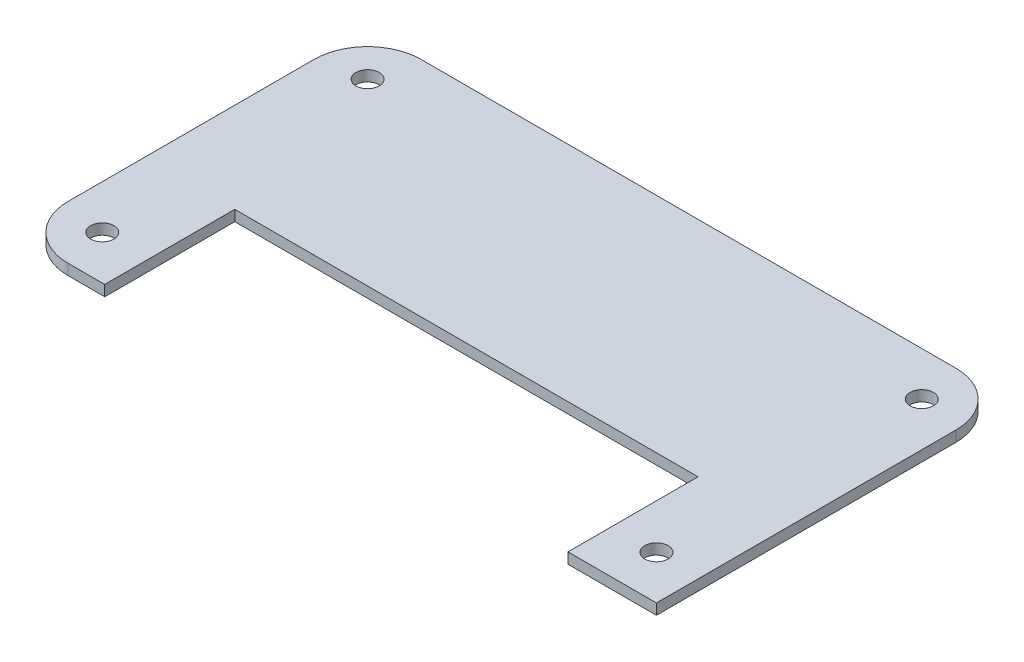
ISO-10303-21;
HEADER;
FILE_DESCRIPTION(('STEP AP214'),'2;1');
FILE_NAME('part.step','',(''),(''),'','','');
FILE_SCHEMA(('AUTOMOTIVE_DESIGN { 1 0 10303 214 1 1 1 1 }'));
ENDSEC;
DATA;
#1=APPLICATION_CONTEXT('core data for automotive mechanical design processes');
#2=APPLICATION_PROTOCOL_DEFINITION('international standard','automotive_design',2000,#1);
#3=PRODUCT_CONTEXT('',#1,'mechanical');
#4=PRODUCT('Part','Part','',(#3));
#5=PRODUCT_RELATED_PRODUCT_CATEGORY('part','',(#4));
#6=PRODUCT_DEFINITION_FORMATION('','',#4);
#7=PRODUCT_DEFINITION_CONTEXT('part definition',#1,'design');
#8=PRODUCT_DEFINITION('design','',#6,#7);
#9=PRODUCT_DEFINITION_SHAPE('','',#8);
#10=(LENGTH_UNIT() NAMED_UNIT(*) SI_UNIT(.MILLI.,.METRE.));
#11=(NAMED_UNIT(*) PLANE_ANGLE_UNIT() SI_UNIT($,.RADIAN.));
#12=(NAMED_UNIT(*) SI_UNIT($,.STERADIAN.) SOLID_ANGLE_UNIT());
#13=UNCERTAINTY_MEASURE_WITH_UNIT(LENGTH_MEASURE(1.E-05),#10,'distance_accuracy_value','');
#14=(GEOMETRIC_REPRESENTATION_CONTEXT(3) GLOBAL_UNCERTAINTY_ASSIGNED_CONTEXT((#13)) GLOBAL_UNIT_ASSIGNED_CONTEXT((#10,
#11,#12)) REPRESENTATION_CONTEXT('',''));
#15=CARTESIAN_POINT('',(0.,0.,0.));
#16=DIRECTION('',(0.,0.,1.));
#17=DIRECTION('',(1.,0.,0.));
#18=AXIS2_PLACEMENT_3D('',#15,#16,#17);
#19=CARTESIAN_POINT('',(-10.,2.,-56.));
#20=DIRECTION('',(0.,1.,0.));
#21=DIRECTION('',(0.,0.,1.));
#22=AXIS2_PLACEMENT_3D('',#19,#20,#21);
#23=PLANE('',#22);
#24=CARTESIAN_POINT('',(-111.8,2.,-57.8));
#25=DIRECTION('',(0.,1.,0.));
#26=DIRECTION('',(0.,0.,1.));
#27=AXIS2_PLACEMENT_3D('',#24,#25,#26);
#28=CIRCLE('',#27,2.175);
#29=CARTESIAN_POINT('',(-111.8,2.,-55.625));
#30=VERTEX_POINT('',#29);
#31=EDGE_CURVE('E277',#30,#30,#28,.T.);
#32=ORIENTED_EDGE('',*,*,#31,.F.);
#33=EDGE_LOOP('',(#32));
#34=FACE_BOUND('',#33,.T.);
#35=CARTESIAN_POINT('',(-8.20000000000001,2.,-8.2));
#36=DIRECTION('',(0.,1.,0.));
#37=DIRECTION('',(0.,0.,1.));
#38=AXIS2_PLACEMENT_3D('',#35,#36,#37);
#39=CIRCLE('',#38,2.175);
#40=CARTESIAN_POINT('',(-8.20000000000001,2.,-6.025));
#41=VERTEX_POINT('',#40);
#42=EDGE_CURVE('E152',#41,#41,#39,.T.);
#43=ORIENTED_EDGE('',*,*,#42,.F.);
#44=EDGE_LOOP('',(#43));
#45=FACE_BOUND('',#44,.T.);
#46=DIRECTION('',(1.,0.,0.));
#47=VECTOR('',#46,1.);
#48=CARTESIAN_POINT('',(-16.5419111635701,2.,0.));
#49=LINE('',#48,#47);
#50=CARTESIAN_POINT('',(-16.5419111635701,2.,0.));
#51=VERTEX_POINT('',#50);
#52=CARTESIAN_POINT('',(0.,2.,0.));
#53=VERTEX_POINT('',#52);
#54=EDGE_CURVE('E169',#51,#53,#49,.T.);
#55=ORIENTED_EDGE('',*,*,#54,.T.);
#56=DIRECTION('',(0.,0.,-1.));
#57=VECTOR('',#56,1.);
#58=CARTESIAN_POINT('',(0.,2.,0.));
#59=LINE('',#58,#57);
#60=CARTESIAN_POINT('',(0.,2.,-56.));
#61=VERTEX_POINT('',#60);
#62=EDGE_CURVE('E102',#53,#61,#59,.T.);
#63=ORIENTED_EDGE('',*,*,#62,.T.);
#64=CARTESIAN_POINT('',(-10.,2.,-56.));
#65=DIRECTION('',(0.,1.,0.));
#66=DIRECTION('',(0.,0.,1.));
#67=AXIS2_PLACEMENT_3D('',#64,#65,#66);
#68=CIRCLE('',#67,10.);
#69=CARTESIAN_POINT('',(-10.,2.,-66.));
#70=VERTEX_POINT('',#69);
#71=EDGE_CURVE('E193',#61,#70,#68,.T.);
#72=ORIENTED_EDGE('',*,*,#71,.T.);
#73=DIRECTION('',(-1.,0.,0.));
#74=VECTOR('',#73,1.);
#75=CARTESIAN_POINT('',(-10.,2.,-66.));
#76=LINE('',#75,#74);
#77=CARTESIAN_POINT('',(-110.,2.,-66.));
#78=VERTEX_POINT('',#77);
#79=EDGE_CURVE('E212',#70,#78,#76,.T.);
#80=ORIENTED_EDGE('',*,*,#79,.T.);
#81=CARTESIAN_POINT('',(-110.,2.,-56.));
#82=DIRECTION('',(0.,1.,0.));
#83=DIRECTION('',(0.,0.,1.));
#84=AXIS2_PLACEMENT_3D('',#81,#82,#83);
#85=CIRCLE('',#84,10.);
#86=CARTESIAN_POINT('',(-120.,2.,-56.));
#87=VERTEX_POINT('',#86);
#88=EDGE_CURVE('E209',#78,#87,#85,.T.);
#89=ORIENTED_EDGE('',*,*,#88,.T.);
#90=DIRECTION('',(0.,0.,1.));
#91=VECTOR('',#90,1.);
#92=CARTESIAN_POINT('',(-120.,2.,-56.));
#93=LINE('',#92,#91);
#94=CARTESIAN_POINT('',(-120.,2.,-9.99999999999998));
#95=VERTEX_POINT('',#94);
#96=EDGE_CURVE('E211',#87,#95,#93,.T.);
#97=ORIENTED_EDGE('',*,*,#96,.T.);
#98=CARTESIAN_POINT('',(-110.,2.,-9.99999999999998));
#99=DIRECTION('',(0.,1.,0.));
#100=DIRECTION('',(0.,0.,1.));
#101=AXIS2_PLACEMENT_3D('',#98,#99,#100);
#102=CIRCLE('',#101,10.);
#103=CARTESIAN_POINT('',(-110.,2.,0.));
#104=VERTEX_POINT('',#103);
#105=EDGE_CURVE('E214',#95,#104,#102,.T.);
#106=ORIENTED_EDGE('',*,*,#105,.T.);
#107=DIRECTION('',(1.,0.,0.));
#108=VECTOR('',#107,1.);
#109=CARTESIAN_POINT('',(-110.,2.,0.));
#110=LINE('',#109,#108);
#111=CARTESIAN_POINT('',(-103.138364140074,2.,0.));
#112=VERTEX_POINT('',#111);
#113=EDGE_CURVE('E130',#104,#112,#110,.T.);
#114=ORIENTED_EDGE('',*,*,#113,.T.);
#115=DIRECTION('',(0.,0.,-1.));
#116=VECTOR('',#115,1.);
#117=CARTESIAN_POINT('',(-103.138364140074,2.,0.));
#118=LINE('',#117,#116);
#119=CARTESIAN_POINT('',(-103.138364140074,2.,-24.3157054808762));
#120=VERTEX_POINT('',#119);
#121=EDGE_CURVE('E124',#112,#120,#118,.T.);
#122=ORIENTED_EDGE('',*,*,#121,.T.);
#123=DIRECTION('',(1.,0.,0.));
#124=VECTOR('',#123,1.);
#125=CARTESIAN_POINT('',(-103.138364140074,2.,-24.3157054808762));
#126=LINE('',#125,#124);
#127=CARTESIAN_POINT('',(-16.5419111635701,2.,-24.3157054808762));
#128=VERTEX_POINT('',#127);
#129=EDGE_CURVE('E128',#120,#128,#126,.T.);
#130=ORIENTED_EDGE('',*,*,#129,.T.);
#131=DIRECTION('',(0.,0.,1.));
#132=VECTOR('',#131,1.);
#133=CARTESIAN_POINT('',(-16.5419111635701,2.,0.));
#134=LINE('',#133,#132);
#135=EDGE_CURVE('E50',#128,#51,#134,.T.);
#136=ORIENTED_EDGE('',*,*,#135,.T.);
#137=EDGE_LOOP('',(#55,#63,#72,#80,#89,#97,#106,#114,#122,#130,#136));
#138=FACE_BOUND('',#137,.T.);
#139=CARTESIAN_POINT('',(-8.20000000000001,2.,-57.8));
#140=DIRECTION('',(0.,1.,0.));
#141=DIRECTION('',(0.,0.,1.));
#142=AXIS2_PLACEMENT_3D('',#139,#140,#141);
#143=CIRCLE('',#142,2.175);
#144=CARTESIAN_POINT('',(-8.20000000000001,2.,-55.625));
#145=VERTEX_POINT('',#144);
#146=EDGE_CURVE('E283',#145,#145,#143,.T.);
#147=ORIENTED_EDGE('',*,*,#146,.F.);
#148=EDGE_LOOP('',(#147));
#149=FACE_BOUND('',#148,.T.);
#150=CARTESIAN_POINT('',(-111.8,2.,-8.2));
#151=DIRECTION('',(0.,1.,0.));
#152=DIRECTION('',(0.,0.,1.));
#153=AXIS2_PLACEMENT_3D('',#150,#151,#152);
#154=CIRCLE('',#153,2.175);
#155=CARTESIAN_POINT('',(-111.8,2.,-6.025));
#156=VERTEX_POINT('',#155);
#157=EDGE_CURVE('E268',#156,#156,#154,.T.);
#158=ORIENTED_EDGE('',*,*,#157,.F.);
#159=EDGE_LOOP('',(#158));
#160=FACE_BOUND('',#159,.T.);
#161=ADVANCED_FACE('F33',(#34,#45,#138,#149,#160),#23,.T.);
#162=CARTESIAN_POINT('',(-10.,0.,-56.));
#163=DIRECTION('',(0.,1.,0.));
#164=DIRECTION('',(0.,0.,1.));
#165=AXIS2_PLACEMENT_3D('',#162,#163,#164);
#166=PLANE('',#165);
#167=DIRECTION('',(1.,0.,0.));
#168=VECTOR('',#167,1.);
#169=CARTESIAN_POINT('',(-16.5419111635701,0.,0.));
#170=LINE('',#169,#168);
#171=CARTESIAN_POINT('',(-16.5419111635701,0.,0.));
#172=VERTEX_POINT('',#171);
#173=CARTESIAN_POINT('',(0.,0.,0.));
#174=VERTEX_POINT('',#173);
#175=EDGE_CURVE('E148',#172,#174,#170,.T.);
#176=ORIENTED_EDGE('',*,*,#175,.F.);
#177=DIRECTION('',(0.,0.,1.));
#178=VECTOR('',#177,1.);
#179=CARTESIAN_POINT('',(-16.5419111635701,0.,0.));
#180=LINE('',#179,#178);
#181=CARTESIAN_POINT('',(-16.5419111635701,0.,-24.3157054808762));
#182=VERTEX_POINT('',#181);
#183=EDGE_CURVE('E94',#182,#172,#180,.T.);
#184=ORIENTED_EDGE('',*,*,#183,.F.);
#185=DIRECTION('',(1.,0.,0.));
#186=VECTOR('',#185,1.);
#187=CARTESIAN_POINT('',(-103.138364140074,0.,-24.3157054808762));
#188=LINE('',#187,#186);
#189=CARTESIAN_POINT('',(-103.138364140074,0.,-24.3157054808762));
#190=VERTEX_POINT('',#189);
#191=EDGE_CURVE('E88',#190,#182,#188,.T.);
#192=ORIENTED_EDGE('',*,*,#191,.F.);
#193=DIRECTION('',(0.,0.,-1.));
#194=VECTOR('',#193,1.);
#195=CARTESIAN_POINT('',(-103.138364140074,0.,0.));
#196=LINE('',#195,#194);
#197=CARTESIAN_POINT('',(-103.138364140074,0.,0.));
#198=VERTEX_POINT('',#197);
#199=EDGE_CURVE('E138',#198,#190,#196,.T.);
#200=ORIENTED_EDGE('',*,*,#199,.F.);
#201=DIRECTION('',(1.,0.,0.));
#202=VECTOR('',#201,1.);
#203=CARTESIAN_POINT('',(-110.,0.,0.));
#204=LINE('',#203,#202);
#205=CARTESIAN_POINT('',(-110.,0.,0.));
#206=VERTEX_POINT('',#205);
#207=EDGE_CURVE('E164',#206,#198,#204,.T.);
#208=ORIENTED_EDGE('',*,*,#207,.F.);
#209=CARTESIAN_POINT('',(-110.,0.,-9.99999999999998));
#210=DIRECTION('',(0.,1.,0.));
#211=DIRECTION('',(0.,0.,1.));
#212=AXIS2_PLACEMENT_3D('',#209,#210,#211);
#213=CIRCLE('',#212,10.);
#214=CARTESIAN_POINT('',(-120.,0.,-9.99999999999998));
#215=VERTEX_POINT('',#214);
#216=EDGE_CURVE('E162',#215,#206,#213,.T.);
#217=ORIENTED_EDGE('',*,*,#216,.F.);
#218=DIRECTION('',(0.,0.,1.));
#219=VECTOR('',#218,1.);
#220=CARTESIAN_POINT('',(-120.,0.,-56.));
#221=LINE('',#220,#219);
#222=CARTESIAN_POINT('',(-120.,0.,-56.));
#223=VERTEX_POINT('',#222);
#224=EDGE_CURVE('E160',#223,#215,#221,.T.);
#225=ORIENTED_EDGE('',*,*,#224,.F.);
#226=CARTESIAN_POINT('',(-110.,0.,-56.));
#227=DIRECTION('',(0.,1.,0.));
#228=DIRECTION('',(0.,0.,1.));
#229=AXIS2_PLACEMENT_3D('',#226,#227,#228);
#230=CIRCLE('',#229,10.);
#231=CARTESIAN_POINT('',(-110.,0.,-66.));
#232=VERTEX_POINT('',#231);
#233=EDGE_CURVE('E158',#232,#223,#230,.T.);
#234=ORIENTED_EDGE('',*,*,#233,.F.);
#235=DIRECTION('',(-1.,0.,0.));
#236=VECTOR('',#235,1.);
#237=CARTESIAN_POINT('',(-10.,0.,-66.));
#238=LINE('',#237,#236);
#239=CARTESIAN_POINT('',(-10.,0.,-66.));
#240=VERTEX_POINT('',#239);
#241=EDGE_CURVE('E156',#240,#232,#238,.T.);
#242=ORIENTED_EDGE('',*,*,#241,.F.);
#243=CARTESIAN_POINT('',(-10.,0.,-56.));
#244=DIRECTION('',(0.,1.,0.));
#245=DIRECTION('',(0.,0.,1.));
#246=AXIS2_PLACEMENT_3D('',#243,#244,#245);
#247=CIRCLE('',#246,10.);
#248=CARTESIAN_POINT('',(0.,0.,-56.));
#249=VERTEX_POINT('',#248);
#250=EDGE_CURVE('E154',#249,#240,#247,.T.);
#251=ORIENTED_EDGE('',*,*,#250,.F.);
#252=DIRECTION('',(0.,0.,-1.));
#253=VECTOR('',#252,1.);
#254=CARTESIAN_POINT('',(0.,0.,0.));
#255=LINE('',#254,#253);
#256=EDGE_CURVE('E151',#174,#249,#255,.T.);
#257=ORIENTED_EDGE('',*,*,#256,.F.);
#258=EDGE_LOOP('',(#176,#184,#192,#200,#208,#217,#225,#234,#242,#251,#257));
#259=FACE_BOUND('',#258,.T.);
#260=CARTESIAN_POINT('',(-8.20000000000001,0.,-8.2));
#261=DIRECTION('',(0.,1.,0.));
#262=DIRECTION('',(0.,0.,1.));
#263=AXIS2_PLACEMENT_3D('',#260,#261,#262);
#264=CIRCLE('',#263,2.175);
#265=CARTESIAN_POINT('',(-8.20000000000001,0.,-6.025));
#266=VERTEX_POINT('',#265);
#267=EDGE_CURVE('E286',#266,#266,#264,.T.);
#268=ORIENTED_EDGE('',*,*,#267,.T.);
#269=EDGE_LOOP('',(#268));
#270=FACE_BOUND('',#269,.T.);
#271=CARTESIAN_POINT('',(-8.20000000000001,0.,-57.8));
#272=DIRECTION('',(0.,1.,0.));
#273=DIRECTION('',(0.,0.,1.));
#274=AXIS2_PLACEMENT_3D('',#271,#272,#273);
#275=CIRCLE('',#274,2.175);
#276=CARTESIAN_POINT('',(-8.20000000000001,0.,-55.625));
#277=VERTEX_POINT('',#276);
#278=EDGE_CURVE('E280',#277,#277,#275,.T.);
#279=ORIENTED_EDGE('',*,*,#278,.T.);
#280=EDGE_LOOP('',(#279));
#281=FACE_BOUND('',#280,.T.);
#282=CARTESIAN_POINT('',(-111.8,0.,-57.8));
#283=DIRECTION('',(0.,1.,0.));
#284=DIRECTION('',(0.,0.,1.));
#285=AXIS2_PLACEMENT_3D('',#282,#283,#284);
#286=CIRCLE('',#285,2.175);
#287=CARTESIAN_POINT('',(-111.8,0.,-55.625));
#288=VERTEX_POINT('',#287);
#289=EDGE_CURVE('E274',#288,#288,#286,.T.);
#290=ORIENTED_EDGE('',*,*,#289,.T.);
#291=EDGE_LOOP('',(#290));
#292=FACE_BOUND('',#291,.T.);
#293=CARTESIAN_POINT('',(-111.8,0.,-8.2));
#294=DIRECTION('',(0.,1.,0.));
#295=DIRECTION('',(0.,0.,1.));
#296=AXIS2_PLACEMENT_3D('',#293,#294,#295);
#297=CIRCLE('',#296,2.175);
#298=CARTESIAN_POINT('',(-111.8,0.,-6.025));
#299=VERTEX_POINT('',#298);
#300=EDGE_CURVE('E271',#299,#299,#297,.T.);
#301=ORIENTED_EDGE('',*,*,#300,.T.);
#302=EDGE_LOOP('',(#301));
#303=FACE_BOUND('',#302,.T.);
#304=ADVANCED_FACE('F197',(#259,#270,#281,#292,#303),#166,.F.);
#305=CARTESIAN_POINT('',(-16.5419111635701,2.,0.));
#306=DIRECTION('',(0.,0.,-1.));
#307=DIRECTION('',(-1.,0.,0.));
#308=AXIS2_PLACEMENT_3D('',#305,#306,#307);
#309=PLANE('',#308);
#310=ORIENTED_EDGE('',*,*,#175,.T.);
#311=DIRECTION('',(0.,-1.,0.));
#312=VECTOR('',#311,1.);
#313=CARTESIAN_POINT('',(0.,2.,0.));
#314=LINE('',#313,#312);
#315=EDGE_CURVE('E11',#53,#174,#314,.T.);
#316=ORIENTED_EDGE('',*,*,#315,.F.);
#317=ORIENTED_EDGE('',*,*,#54,.F.);
#318=DIRECTION('',(0.,-1.,0.));
#319=VECTOR('',#318,1.);
#320=CARTESIAN_POINT('',(-16.5419111635701,2.,0.));
#321=LINE('',#320,#319);
#322=EDGE_CURVE('E144',#51,#172,#321,.T.);
#323=ORIENTED_EDGE('',*,*,#322,.T.);
#324=EDGE_LOOP('',(#310,#316,#317,#323));
#325=FACE_BOUND('',#324,.T.);
#326=ADVANCED_FACE('F35',(#325),#309,.F.);
#327=CARTESIAN_POINT('',(0.,2.,0.));
#328=DIRECTION('',(-1.,0.,0.));
#329=DIRECTION('',(0.,0.,1.));
#330=AXIS2_PLACEMENT_3D('',#327,#328,#329);
#331=PLANE('',#330);
#332=ORIENTED_EDGE('',*,*,#256,.T.);
#333=DIRECTION('',(0.,-1.,0.));
#334=VECTOR('',#333,1.);
#335=CARTESIAN_POINT('',(0.,2.,-56.));
#336=LINE('',#335,#334);
#337=EDGE_CURVE('E42',#61,#249,#336,.T.);
#338=ORIENTED_EDGE('',*,*,#337,.F.);
#339=ORIENTED_EDGE('',*,*,#62,.F.);
#340=ORIENTED_EDGE('',*,*,#315,.T.);
#341=EDGE_LOOP('',(#332,#338,#339,#340));
#342=FACE_BOUND('',#341,.T.);
#343=ADVANCED_FACE('F386',(#342),#331,.F.);
#344=CARTESIAN_POINT('',(-10.,2.,-56.));
#345=DIRECTION('',(0.,-1.,0.));
#346=DIRECTION('',(0.,0.,-1.));
#347=AXIS2_PLACEMENT_3D('',#344,#345,#346);
#348=CYLINDRICAL_SURFACE('',#347,10.);
#349=ORIENTED_EDGE('',*,*,#250,.T.);
#350=DIRECTION('',(0.,-1.,0.));
#351=VECTOR('',#350,1.);
#352=CARTESIAN_POINT('',(-10.,2.,-66.));
#353=LINE('',#352,#351);
#354=EDGE_CURVE('E185',#70,#240,#353,.T.);
#355=ORIENTED_EDGE('',*,*,#354,.F.);
#356=ORIENTED_EDGE('',*,*,#71,.F.);
#357=ORIENTED_EDGE('',*,*,#337,.T.);
#358=EDGE_LOOP('',(#349,#355,#356,#357));
#359=FACE_BOUND('',#358,.T.);
#360=ADVANCED_FACE('F191',(#359),#348,.T.);
#361=CARTESIAN_POINT('',(-10.,2.,-66.));
#362=DIRECTION('',(0.,0.,1.));
#363=DIRECTION('',(1.,0.,0.));
#364=AXIS2_PLACEMENT_3D('',#361,#362,#363);
#365=PLANE('',#364);
#366=ORIENTED_EDGE('',*,*,#241,.T.);
#367=DIRECTION('',(0.,-1.,0.));
#368=VECTOR('',#367,1.);
#369=CARTESIAN_POINT('',(-110.,2.,-66.));
#370=LINE('',#369,#368);
#371=EDGE_CURVE('E182',#78,#232,#370,.T.);
#372=ORIENTED_EDGE('',*,*,#371,.F.);
#373=ORIENTED_EDGE('',*,*,#79,.F.);
#374=ORIENTED_EDGE('',*,*,#354,.T.);
#375=EDGE_LOOP('',(#366,#372,#373,#374));
#376=FACE_BOUND('',#375,.T.);
#377=ADVANCED_FACE('F203',(#376),#365,.F.);
#378=CARTESIAN_POINT('',(-110.,2.,-56.));
#379=DIRECTION('',(0.,-1.,0.));
#380=DIRECTION('',(0.,0.,-1.));
#381=AXIS2_PLACEMENT_3D('',#378,#379,#380);
#382=CYLINDRICAL_SURFACE('',#381,10.);
#383=ORIENTED_EDGE('',*,*,#233,.T.);
#384=DIRECTION('',(0.,-1.,0.));
#385=VECTOR('',#384,1.);
#386=CARTESIAN_POINT('',(-120.,2.,-56.));
#387=LINE('',#386,#385);
#388=EDGE_CURVE('E179',#87,#223,#387,.T.);
#389=ORIENTED_EDGE('',*,*,#388,.F.);
#390=ORIENTED_EDGE('',*,*,#88,.F.);
#391=ORIENTED_EDGE('',*,*,#371,.T.);
#392=EDGE_LOOP('',(#383,#389,#390,#391));
#393=FACE_BOUND('',#392,.T.);
#394=ADVANCED_FACE('F207',(#393),#382,.T.);
#395=CARTESIAN_POINT('',(-120.,2.,-56.));
#396=DIRECTION('',(1.,0.,0.));
#397=DIRECTION('',(0.,0.,-1.));
#398=AXIS2_PLACEMENT_3D('',#395,#396,#397);
#399=PLANE('',#398);
#400=ORIENTED_EDGE('',*,*,#224,.T.);
#401=DIRECTION('',(0.,-1.,0.));
#402=VECTOR('',#401,1.);
#403=CARTESIAN_POINT('',(-120.,2.,-9.99999999999998));
#404=LINE('',#403,#402);
#405=EDGE_CURVE('E176',#95,#215,#404,.T.);
#406=ORIENTED_EDGE('',*,*,#405,.F.);
#407=ORIENTED_EDGE('',*,*,#96,.F.);
#408=ORIENTED_EDGE('',*,*,#388,.T.);
#409=EDGE_LOOP('',(#400,#406,#407,#408));
#410=FACE_BOUND('',#409,.T.);
#411=ADVANCED_FACE('F352',(#410),#399,.F.);
#412=CARTESIAN_POINT('',(-110.,2.,-9.99999999999998));
#413=DIRECTION('',(0.,-1.,0.));
#414=DIRECTION('',(0.,0.,-1.));
#415=AXIS2_PLACEMENT_3D('',#412,#413,#414);
#416=CYLINDRICAL_SURFACE('',#415,10.);
#417=ORIENTED_EDGE('',*,*,#216,.T.);
#418=DIRECTION('',(0.,-1.,0.));
#419=VECTOR('',#418,1.);
#420=CARTESIAN_POINT('',(-110.,2.,0.));
#421=LINE('',#420,#419);
#422=EDGE_CURVE('E173',#104,#206,#421,.T.);
#423=ORIENTED_EDGE('',*,*,#422,.F.);
#424=ORIENTED_EDGE('',*,*,#105,.F.);
#425=ORIENTED_EDGE('',*,*,#405,.T.);
#426=EDGE_LOOP('',(#417,#423,#424,#425));
#427=FACE_BOUND('',#426,.T.);
#428=ADVANCED_FACE('F223',(#427),#416,.T.);
#429=CARTESIAN_POINT('',(-110.,2.,0.));
#430=DIRECTION('',(0.,0.,-1.));
#431=DIRECTION('',(-1.,0.,0.));
#432=AXIS2_PLACEMENT_3D('',#429,#430,#431);
#433=PLANE('',#432);
#434=ORIENTED_EDGE('',*,*,#207,.T.);
#435=DIRECTION('',(0.,-1.,0.));
#436=VECTOR('',#435,1.);
#437=CARTESIAN_POINT('',(-103.138364140074,2.,0.));
#438=LINE('',#437,#436);
#439=EDGE_CURVE('E139',#112,#198,#438,.T.);
#440=ORIENTED_EDGE('',*,*,#439,.F.);
#441=ORIENTED_EDGE('',*,*,#113,.F.);
#442=ORIENTED_EDGE('',*,*,#422,.T.);
#443=EDGE_LOOP('',(#434,#440,#441,#442));
#444=FACE_BOUND('',#443,.T.);
#445=ADVANCED_FACE('F227',(#444),#433,.F.);
#446=CARTESIAN_POINT('',(-103.138364140074,2.,0.));
#447=DIRECTION('',(-1.,0.,0.));
#448=DIRECTION('',(0.,0.,1.));
#449=AXIS2_PLACEMENT_3D('',#446,#447,#448);
#450=PLANE('',#449);
#451=ORIENTED_EDGE('',*,*,#199,.T.);
#452=DIRECTION('',(0.,-1.,0.));
#453=VECTOR('',#452,1.);
#454=CARTESIAN_POINT('',(-103.138364140074,2.,-24.3157054808762));
#455=LINE('',#454,#453);
#456=EDGE_CURVE('E135',#120,#190,#455,.T.);
#457=ORIENTED_EDGE('',*,*,#456,.F.);
#458=ORIENTED_EDGE('',*,*,#121,.F.);
#459=ORIENTED_EDGE('',*,*,#439,.T.);
#460=EDGE_LOOP('',(#451,#457,#458,#459));
#461=FACE_BOUND('',#460,.T.);
#462=ADVANCED_FACE('F136',(#461),#450,.F.);
#463=CARTESIAN_POINT('',(-103.138364140074,2.,-24.3157054808762));
#464=DIRECTION('',(0.,0.,-1.));
#465=DIRECTION('',(-1.,0.,0.));
#466=AXIS2_PLACEMENT_3D('',#463,#464,#465);
#467=PLANE('',#466);
#468=ORIENTED_EDGE('',*,*,#191,.T.);
#469=DIRECTION('',(0.,-1.,0.));
#470=VECTOR('',#469,1.);
#471=CARTESIAN_POINT('',(-16.5419111635701,2.,-24.3157054808762));
#472=LINE('',#471,#470);
#473=EDGE_CURVE('E140',#128,#182,#472,.T.);
#474=ORIENTED_EDGE('',*,*,#473,.F.);
#475=ORIENTED_EDGE('',*,*,#129,.F.);
#476=ORIENTED_EDGE('',*,*,#456,.T.);
#477=EDGE_LOOP('',(#468,#474,#475,#476));
#478=FACE_BOUND('',#477,.T.);
#479=ADVANCED_FACE('F142',(#478),#467,.F.);
#480=CARTESIAN_POINT('',(-16.5419111635701,2.,0.));
#481=DIRECTION('',(1.,0.,0.));
#482=DIRECTION('',(0.,0.,-1.));
#483=AXIS2_PLACEMENT_3D('',#480,#481,#482);
#484=PLANE('',#483);
#485=ORIENTED_EDGE('',*,*,#183,.T.);
#486=ORIENTED_EDGE('',*,*,#322,.F.);
#487=ORIENTED_EDGE('',*,*,#135,.F.);
#488=ORIENTED_EDGE('',*,*,#473,.T.);
#489=EDGE_LOOP('',(#485,#486,#487,#488));
#490=FACE_BOUND('',#489,.T.);
#491=ADVANCED_FACE('F231',(#490),#484,.F.);
#492=CARTESIAN_POINT('',(-8.20000000000001,2.,-8.2));
#493=DIRECTION('',(0.,-1.,0.));
#494=DIRECTION('',(0.,0.,-1.));
#495=AXIS2_PLACEMENT_3D('',#492,#493,#494);
#496=CYLINDRICAL_SURFACE('',#495,2.175);
#497=ORIENTED_EDGE('',*,*,#42,.T.);
#498=EDGE_LOOP('',(#497));
#499=FACE_BOUND('',#498,.T.);
#500=ORIENTED_EDGE('',*,*,#267,.F.);
#501=EDGE_LOOP('',(#500));
#502=FACE_BOUND('',#501,.T.);
#503=ADVANCED_FACE('F233',(#499,#502),#496,.F.);
#504=CARTESIAN_POINT('',(-8.20000000000001,2.,-57.8));
#505=DIRECTION('',(0.,-1.,0.));
#506=DIRECTION('',(0.,0.,-1.));
#507=AXIS2_PLACEMENT_3D('',#504,#505,#506);
#508=CYLINDRICAL_SURFACE('',#507,2.175);
#509=ORIENTED_EDGE('',*,*,#146,.T.);
#510=EDGE_LOOP('',(#509));
#511=FACE_BOUND('',#510,.T.);
#512=ORIENTED_EDGE('',*,*,#278,.F.);
#513=EDGE_LOOP('',(#512));
#514=FACE_BOUND('',#513,.T.);
#515=ADVANCED_FACE('F239',(#511,#514),#508,.F.);
#516=CARTESIAN_POINT('',(-111.8,2.,-57.8));
#517=DIRECTION('',(0.,-1.,0.));
#518=DIRECTION('',(0.,0.,-1.));
#519=AXIS2_PLACEMENT_3D('',#516,#517,#518);
#520=CYLINDRICAL_SURFACE('',#519,2.175);
#521=ORIENTED_EDGE('',*,*,#31,.T.);
#522=EDGE_LOOP('',(#521));
#523=FACE_BOUND('',#522,.T.);
#524=ORIENTED_EDGE('',*,*,#289,.F.);
#525=EDGE_LOOP('',(#524));
#526=FACE_BOUND('',#525,.T.);
#527=ADVANCED_FACE('F255',(#523,#526),#520,.F.);
#528=CARTESIAN_POINT('',(-111.8,2.,-8.2));
#529=DIRECTION('',(0.,-1.,0.));
#530=DIRECTION('',(0.,0.,-1.));
#531=AXIS2_PLACEMENT_3D('',#528,#529,#530);
#532=CYLINDRICAL_SURFACE('',#531,2.175);
#533=ORIENTED_EDGE('',*,*,#157,.T.);
#534=EDGE_LOOP('',(#533));
#535=FACE_BOUND('',#534,.T.);
#536=ORIENTED_EDGE('',*,*,#300,.F.);
#537=EDGE_LOOP('',(#536));
#538=FACE_BOUND('',#537,.T.);
#539=ADVANCED_FACE('F259',(#535,#538),#532,.F.);
#540=CLOSED_SHELL('',(#161,#304,#326,#343,#360,#377,#394,#411,#428,#445,#462,#479,#491,#503,
#515,#527,#539));
#541=MANIFOLD_SOLID_BREP('B2',#540);
#542=ADVANCED_BREP_SHAPE_REPRESENTATION('',(#18,#541),#14);
#543=SHAPE_DEFINITION_REPRESENTATION(#9,#542);
ENDSEC;
END-ISO-10303-21;
